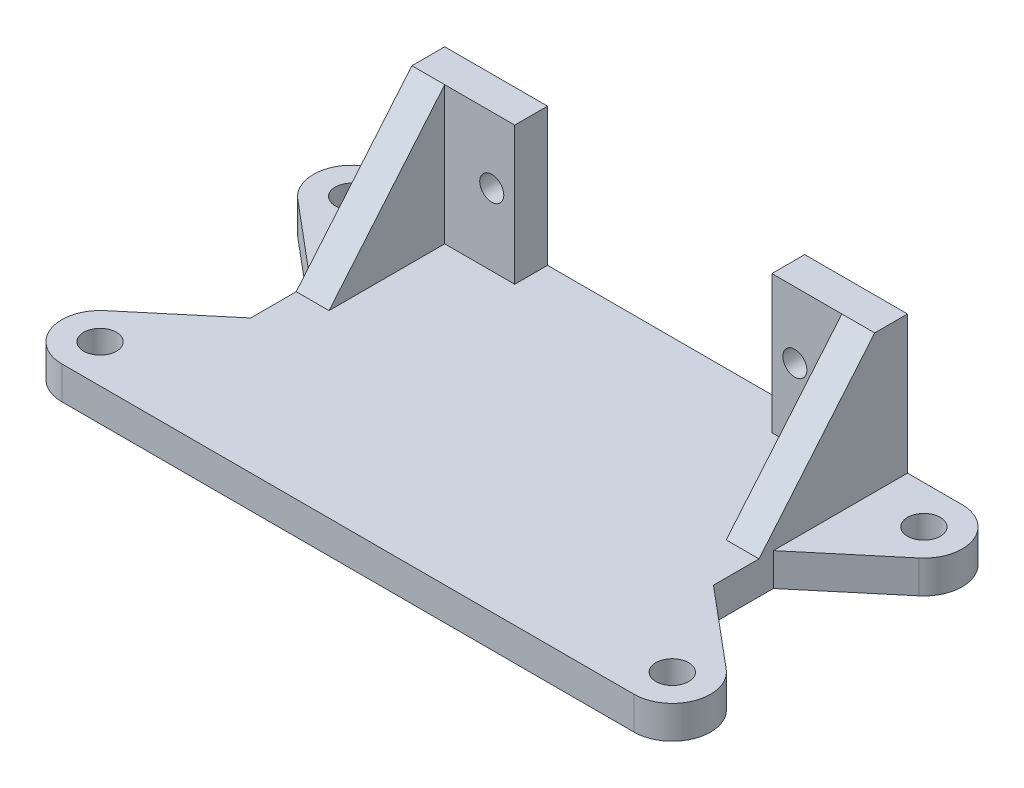
ISO-10303-21;
HEADER;
FILE_DESCRIPTION(('STEP AP214'),'2;1');
FILE_NAME('part.step','',(''),(''),'','','');
FILE_SCHEMA(('AUTOMOTIVE_DESIGN { 1 0 10303 214 1 1 1 1 }'));
ENDSEC;
DATA;
#1=APPLICATION_CONTEXT('core data for automotive mechanical design processes');
#2=APPLICATION_PROTOCOL_DEFINITION('international standard','automotive_design',2000,#1);
#3=PRODUCT_CONTEXT('',#1,'mechanical');
#4=PRODUCT('Part','Part','',(#3));
#5=PRODUCT_RELATED_PRODUCT_CATEGORY('part','',(#4));
#6=PRODUCT_DEFINITION_FORMATION('','',#4);
#7=PRODUCT_DEFINITION_CONTEXT('part definition',#1,'design');
#8=PRODUCT_DEFINITION('design','',#6,#7);
#9=PRODUCT_DEFINITION_SHAPE('','',#8);
#10=(LENGTH_UNIT() NAMED_UNIT(*) SI_UNIT(.MILLI.,.METRE.));
#11=(NAMED_UNIT(*) PLANE_ANGLE_UNIT() SI_UNIT($,.RADIAN.));
#12=(NAMED_UNIT(*) SI_UNIT($,.STERADIAN.) SOLID_ANGLE_UNIT());
#13=UNCERTAINTY_MEASURE_WITH_UNIT(LENGTH_MEASURE(1.E-05),#10,'distance_accuracy_value','');
#14=(GEOMETRIC_REPRESENTATION_CONTEXT(3) GLOBAL_UNCERTAINTY_ASSIGNED_CONTEXT((#13)) GLOBAL_UNIT_ASSIGNED_CONTEXT((#10,
#11,#12)) REPRESENTATION_CONTEXT('',''));
#15=CARTESIAN_POINT('',(0.,0.,0.));
#16=DIRECTION('',(0.,0.,1.));
#17=DIRECTION('',(1.,0.,0.));
#18=AXIS2_PLACEMENT_3D('',#15,#16,#17);
#19=CARTESIAN_POINT('',(21.15,15.6,3.));
#20=DIRECTION('',(1.,0.,0.));
#21=DIRECTION('',(0.,1.,0.));
#22=AXIS2_PLACEMENT_3D('',#19,#20,#21);
#23=PLANE('',#22);
#24=DIRECTION('',(0.,-1.,0.));
#25=VECTOR('',#24,1.);
#26=CARTESIAN_POINT('',(21.15,17.9220001314058,12.2644236685494));
#27=LINE('',#26,#25);
#28=CARTESIAN_POINT('',(21.15,2.99999999999999,12.2644236685494));
#29=VERTEX_POINT('',#28);
#30=CARTESIAN_POINT('',(21.15,0.,12.2644236685494));
#31=VERTEX_POINT('',#30);
#32=EDGE_CURVE('E205',#29,#31,#27,.T.);
#33=ORIENTED_EDGE('',*,*,#32,.F.);
#34=DIRECTION('',(0.,0.,-1.));
#35=VECTOR('',#34,1.);
#36=CARTESIAN_POINT('',(21.15,2.99999999999999,0.));
#37=LINE('',#36,#35);
#38=CARTESIAN_POINT('',(21.15,2.99999999999999,0.));
#39=VERTEX_POINT('',#38);
#40=EDGE_CURVE('E227',#29,#39,#37,.T.);
#41=ORIENTED_EDGE('',*,*,#40,.T.);
#42=DIRECTION('',(0.,-1.,0.));
#43=VECTOR('',#42,1.);
#44=CARTESIAN_POINT('',(21.15,15.6,0.));
#45=LINE('',#44,#43);
#46=CARTESIAN_POINT('',(21.15,15.6,0.));
#47=VERTEX_POINT('',#46);
#48=EDGE_CURVE('E220',#47,#39,#45,.T.);
#49=ORIENTED_EDGE('',*,*,#48,.F.);
#50=DIRECTION('',(0.,0.,-1.));
#51=VECTOR('',#50,1.);
#52=CARTESIAN_POINT('',(21.15,15.6,3.));
#53=LINE('',#52,#51);
#54=CARTESIAN_POINT('',(21.15,15.6,3.));
#55=VERTEX_POINT('',#54);
#56=EDGE_CURVE('E40',#55,#47,#53,.T.);
#57=ORIENTED_EDGE('',*,*,#56,.F.);
#58=DIRECTION('',(0.,-0.766044443118982,0.642787609686535));
#59=VECTOR('',#58,1.);
#60=CARTESIAN_POINT('',(21.15,15.6,3.));
#61=LINE('',#60,#59);
#62=CARTESIAN_POINT('',(21.15,2.99999999999999,13.5726553528336));
#63=VERTEX_POINT('',#62);
#64=EDGE_CURVE('E320',#55,#63,#61,.T.);
#65=ORIENTED_EDGE('',*,*,#64,.T.);
#66=DIRECTION('',(0.,0.,1.));
#67=VECTOR('',#66,1.);
#68=CARTESIAN_POINT('',(21.15,2.99999999999999,0.));
#69=LINE('',#68,#67);
#70=CARTESIAN_POINT('',(21.15,2.99999999999999,17.7355763314506));
#71=VERTEX_POINT('',#70);
#72=EDGE_CURVE('E350',#63,#71,#69,.T.);
#73=ORIENTED_EDGE('',*,*,#72,.T.);
#74=DIRECTION('',(0.,-1.,0.));
#75=VECTOR('',#74,1.);
#76=CARTESIAN_POINT('',(21.15,17.9220001314058,17.7355763314506));
#77=LINE('',#76,#75);
#78=CARTESIAN_POINT('',(21.15,0.,17.7355763314506));
#79=VERTEX_POINT('',#78);
#80=EDGE_CURVE('E245',#71,#79,#77,.T.);
#81=ORIENTED_EDGE('',*,*,#80,.T.);
#82=DIRECTION('',(0.,0.,-1.));
#83=VECTOR('',#82,1.);
#84=CARTESIAN_POINT('',(21.15,0.,3.));
#85=LINE('',#84,#83);
#86=EDGE_CURVE('E403',#79,#31,#85,.T.);
#87=ORIENTED_EDGE('',*,*,#86,.T.);
#88=EDGE_LOOP('',(#33,#41,#49,#57,#65,#73,#81,#87));
#89=FACE_BOUND('',#88,.T.);
#90=ADVANCED_FACE('F36',(#89),#23,.T.);
#91=CARTESIAN_POINT('',(-21.15,0.,3.));
#92=DIRECTION('',(-1.,0.,0.));
#93=DIRECTION('',(0.,-1.,0.));
#94=AXIS2_PLACEMENT_3D('',#91,#92,#93);
#95=PLANE('',#94);
#96=DIRECTION('',(0.,0.,-1.));
#97=VECTOR('',#96,1.);
#98=CARTESIAN_POINT('',(-21.15,2.99999999999999,0.));
#99=LINE('',#98,#97);
#100=CARTESIAN_POINT('',(-21.15,2.99999999999999,12.2644236685494));
#101=VERTEX_POINT('',#100);
#102=CARTESIAN_POINT('',(-21.15,2.99999999999999,0.));
#103=VERTEX_POINT('',#102);
#104=EDGE_CURVE('E61',#101,#103,#99,.T.);
#105=ORIENTED_EDGE('',*,*,#104,.F.);
#106=DIRECTION('',(0.,-1.,0.));
#107=VECTOR('',#106,1.);
#108=CARTESIAN_POINT('',(-21.15,17.9220001314058,12.2644236685494));
#109=LINE('',#108,#107);
#110=CARTESIAN_POINT('',(-21.15,0.,12.2644236685494));
#111=VERTEX_POINT('',#110);
#112=EDGE_CURVE('E271',#101,#111,#109,.T.);
#113=ORIENTED_EDGE('',*,*,#112,.T.);
#114=DIRECTION('',(0.,0.,-1.));
#115=VECTOR('',#114,1.);
#116=CARTESIAN_POINT('',(-21.15,0.,3.));
#117=LINE('',#116,#115);
#118=CARTESIAN_POINT('',(-21.15,0.,17.7355763314506));
#119=VERTEX_POINT('',#118);
#120=EDGE_CURVE('E401',#119,#111,#117,.T.);
#121=ORIENTED_EDGE('',*,*,#120,.F.);
#122=DIRECTION('',(0.,-1.,0.));
#123=VECTOR('',#122,1.);
#124=CARTESIAN_POINT('',(-21.15,17.9220001314058,17.7355763314506));
#125=LINE('',#124,#123);
#126=CARTESIAN_POINT('',(-21.15,2.99999999999999,17.7355763314506));
#127=VERTEX_POINT('',#126);
#128=EDGE_CURVE('E298',#127,#119,#125,.T.);
#129=ORIENTED_EDGE('',*,*,#128,.F.);
#130=DIRECTION('',(0.,0.,-1.));
#131=VECTOR('',#130,1.);
#132=CARTESIAN_POINT('',(-21.15,2.99999999999999,0.));
#133=LINE('',#132,#131);
#134=CARTESIAN_POINT('',(-21.15,2.99999999999999,13.5726553528336));
#135=VERTEX_POINT('',#134);
#136=EDGE_CURVE('E351',#127,#135,#133,.T.);
#137=ORIENTED_EDGE('',*,*,#136,.T.);
#138=DIRECTION('',(0.,-0.766044443118982,0.642787609686535));
#139=VECTOR('',#138,1.);
#140=CARTESIAN_POINT('',(-21.15,15.6,3.));
#141=LINE('',#140,#139);
#142=CARTESIAN_POINT('',(-21.15,15.6,3.));
#143=VERTEX_POINT('',#142);
#144=EDGE_CURVE('E295',#143,#135,#141,.T.);
#145=ORIENTED_EDGE('',*,*,#144,.F.);
#146=DIRECTION('',(0.,0.,-1.));
#147=VECTOR('',#146,1.);
#148=CARTESIAN_POINT('',(-21.15,15.6,3.));
#149=LINE('',#148,#147);
#150=CARTESIAN_POINT('',(-21.15,15.6,0.));
#151=VERTEX_POINT('',#150);
#152=EDGE_CURVE('E398',#143,#151,#149,.T.);
#153=ORIENTED_EDGE('',*,*,#152,.T.);
#154=DIRECTION('',(0.,1.,0.));
#155=VECTOR('',#154,1.);
#156=CARTESIAN_POINT('',(-21.15,0.,0.));
#157=LINE('',#156,#155);
#158=EDGE_CURVE('E380',#103,#151,#157,.T.);
#159=ORIENTED_EDGE('',*,*,#158,.F.);
#160=EDGE_LOOP('',(#105,#113,#121,#129,#137,#145,#153,#159));
#161=FACE_BOUND('',#160,.T.);
#162=ADVANCED_FACE('F465',(#161),#95,.T.);
#163=CARTESIAN_POINT('',(-11.75,2.99999999999999,3.));
#164=DIRECTION('',(0.,1.,0.));
#165=DIRECTION('',(0.,0.,1.));
#166=AXIS2_PLACEMENT_3D('',#163,#164,#165);
#167=PLANE('',#166);
#168=DIRECTION('',(0.,0.,-1.));
#169=VECTOR('',#168,1.);
#170=CARTESIAN_POINT('',(-18.15,2.99999999999999,13.5726553528336));
#171=LINE('',#170,#169);
#172=CARTESIAN_POINT('',(-18.15,2.99999999999999,13.5726553528336));
#173=VERTEX_POINT('',#172);
#174=CARTESIAN_POINT('',(-18.15,2.99999999999999,3.));
#175=VERTEX_POINT('',#174);
#176=EDGE_CURVE('E311',#173,#175,#171,.T.);
#177=ORIENTED_EDGE('',*,*,#176,.F.);
#178=DIRECTION('',(-1.,0.,0.));
#179=VECTOR('',#178,1.);
#180=CARTESIAN_POINT('',(-18.15,2.99999999999999,13.5726553528336));
#181=LINE('',#180,#179);
#182=EDGE_CURVE('E315',#173,#135,#181,.T.);
#183=ORIENTED_EDGE('',*,*,#182,.T.);
#184=ORIENTED_EDGE('',*,*,#136,.F.);
#185=DIRECTION('',(0.76604444311898,0.,-0.642787609686538));
#186=VECTOR('',#185,1.);
#187=CARTESIAN_POINT('',(-28.3997566339029,2.99999999999999,23.8188444490836));
#188=LINE('',#187,#186);
#189=CARTESIAN_POINT('',(-28.3997566339029,2.99999999999999,23.8188444490836));
#190=VERTEX_POINT('',#189);
#191=EDGE_CURVE('E275',#190,#127,#188,.T.);
#192=ORIENTED_EDGE('',*,*,#191,.F.);
#193=CARTESIAN_POINT('',(-26.15,2.99999999999999,26.5));
#194=DIRECTION('',(0.,1.,0.));
#195=DIRECTION('',(0.,0.,1.));
#196=AXIS2_PLACEMENT_3D('',#193,#194,#195);
#197=CIRCLE('',#196,3.5);
#198=CARTESIAN_POINT('',(-26.15,2.99999999999999,30.));
#199=VERTEX_POINT('',#198);
#200=EDGE_CURVE('E299',#199,#190,#197,.F.);
#201=ORIENTED_EDGE('',*,*,#200,.F.);
#202=DIRECTION('',(-1.,0.,0.));
#203=VECTOR('',#202,1.);
#204=CARTESIAN_POINT('',(-21.15,2.99999999999999,30.));
#205=LINE('',#204,#203);
#206=CARTESIAN_POINT('',(26.15,2.99999999999999,30.));
#207=VERTEX_POINT('',#206);
#208=EDGE_CURVE('E354',#207,#199,#205,.T.);
#209=ORIENTED_EDGE('',*,*,#208,.F.);
#210=CARTESIAN_POINT('',(26.15,2.99999999999999,26.5));
#211=DIRECTION('',(0.,1.,0.));
#212=DIRECTION('',(0.,0.,1.));
#213=AXIS2_PLACEMENT_3D('',#210,#211,#212);
#214=CIRCLE('',#213,3.5);
#215=CARTESIAN_POINT('',(28.3997566339029,2.99999999999999,23.8188444490836));
#216=VERTEX_POINT('',#215);
#217=EDGE_CURVE('E234',#207,#216,#214,.T.);
#218=ORIENTED_EDGE('',*,*,#217,.T.);
#219=DIRECTION('',(-0.76604444311898,0.,-0.642787609686538));
#220=VECTOR('',#219,1.);
#221=CARTESIAN_POINT('',(28.3997566339029,2.99999999999999,23.8188444490836));
#222=LINE('',#221,#220);
#223=EDGE_CURVE('E231',#216,#71,#222,.T.);
#224=ORIENTED_EDGE('',*,*,#223,.T.);
#225=ORIENTED_EDGE('',*,*,#72,.F.);
#226=DIRECTION('',(1.,0.,0.));
#227=VECTOR('',#226,1.);
#228=CARTESIAN_POINT('',(18.15,2.99999999999999,13.5726553528336));
#229=LINE('',#228,#227);
#230=CARTESIAN_POINT('',(18.15,2.99999999999999,13.5726553528336));
#231=VERTEX_POINT('',#230);
#232=EDGE_CURVE('E332',#231,#63,#229,.T.);
#233=ORIENTED_EDGE('',*,*,#232,.F.);
#234=DIRECTION('',(0.,0.,-1.));
#235=VECTOR('',#234,1.);
#236=CARTESIAN_POINT('',(18.15,2.99999999999999,13.5726553528336));
#237=LINE('',#236,#235);
#238=CARTESIAN_POINT('',(18.15,2.99999999999999,3.));
#239=VERTEX_POINT('',#238);
#240=EDGE_CURVE('E326',#231,#239,#237,.T.);
#241=ORIENTED_EDGE('',*,*,#240,.T.);
#242=DIRECTION('',(1.,0.,0.));
#243=VECTOR('',#242,1.);
#244=CARTESIAN_POINT('',(0.,2.99999999999999,3.));
#245=LINE('',#244,#243);
#246=CARTESIAN_POINT('',(11.75,2.99999999999999,3.));
#247=VERTEX_POINT('',#246);
#248=EDGE_CURVE('E353',#247,#239,#245,.T.);
#249=ORIENTED_EDGE('',*,*,#248,.F.);
#250=DIRECTION('',(0.,0.,-1.));
#251=VECTOR('',#250,1.);
#252=CARTESIAN_POINT('',(11.75,2.99999999999999,3.));
#253=LINE('',#252,#251);
#254=CARTESIAN_POINT('',(11.75,2.99999999999999,0.));
#255=VERTEX_POINT('',#254);
#256=EDGE_CURVE('E45',#247,#255,#253,.T.);
#257=ORIENTED_EDGE('',*,*,#256,.T.);
#258=DIRECTION('',(1.,0.,0.));
#259=VECTOR('',#258,1.);
#260=CARTESIAN_POINT('',(-11.75,2.99999999999999,0.));
#261=LINE('',#260,#259);
#262=CARTESIAN_POINT('',(-11.75,2.99999999999999,0.));
#263=VERTEX_POINT('',#262);
#264=EDGE_CURVE('E388',#263,#255,#261,.T.);
#265=ORIENTED_EDGE('',*,*,#264,.F.);
#266=DIRECTION('',(0.,0.,-1.));
#267=VECTOR('',#266,1.);
#268=CARTESIAN_POINT('',(-11.75,2.99999999999999,3.));
#269=LINE('',#268,#267);
#270=CARTESIAN_POINT('',(-11.75,2.99999999999999,3.));
#271=VERTEX_POINT('',#270);
#272=EDGE_CURVE('E394',#271,#263,#269,.T.);
#273=ORIENTED_EDGE('',*,*,#272,.F.);
#274=EDGE_CURVE('E360',#175,#271,#245,.T.);
#275=ORIENTED_EDGE('',*,*,#274,.F.);
#276=EDGE_LOOP('',(#177,#183,#184,#192,#201,#209,#218,#224,#225,#233,#241,#249,#257,#265,#273,#275));
#277=FACE_BOUND('',#276,.T.);
#278=CARTESIAN_POINT('',(-26.15,2.99999999999999,26.5));
#279=DIRECTION('',(0.,1.,0.));
#280=DIRECTION('',(0.,0.,1.));
#281=AXIS2_PLACEMENT_3D('',#278,#279,#280);
#282=CIRCLE('',#281,1.5);
#283=CARTESIAN_POINT('',(-26.15,2.99999999999999,28.));
#284=VERTEX_POINT('',#283);
#285=EDGE_CURVE('E285',#284,#284,#282,.F.);
#286=ORIENTED_EDGE('',*,*,#285,.T.);
#287=EDGE_LOOP('',(#286));
#288=FACE_BOUND('',#287,.T.);
#289=CARTESIAN_POINT('',(26.15,2.99999999999999,26.5));
#290=DIRECTION('',(0.,1.,0.));
#291=DIRECTION('',(0.,0.,1.));
#292=AXIS2_PLACEMENT_3D('',#289,#290,#291);
#293=CIRCLE('',#292,1.5);
#294=CARTESIAN_POINT('',(26.15,2.99999999999999,28.));
#295=VERTEX_POINT('',#294);
#296=EDGE_CURVE('E235',#295,#295,#293,.T.);
#297=ORIENTED_EDGE('',*,*,#296,.F.);
#298=EDGE_LOOP('',(#297));
#299=FACE_BOUND('',#298,.T.);
#300=ADVANCED_FACE('F427',(#277,#288,#299),#167,.T.);
#301=CARTESIAN_POINT('',(0.,0.,3.));
#302=DIRECTION('',(0.,0.,-1.));
#303=DIRECTION('',(-1.,0.,0.));
#304=AXIS2_PLACEMENT_3D('',#301,#302,#303);
#305=PLANE('',#304);
#306=CARTESIAN_POINT('',(-13.85,9.54999999999999,3.));
#307=DIRECTION('',(0.,0.,1.));
#308=DIRECTION('',(1.,0.,0.));
#309=AXIS2_PLACEMENT_3D('',#306,#307,#308);
#310=CIRCLE('',#309,1.1);
#311=CARTESIAN_POINT('',(-12.75,9.54999999999999,3.));
#312=VERTEX_POINT('',#311);
#313=EDGE_CURVE('E334',#312,#312,#310,.T.);
#314=ORIENTED_EDGE('',*,*,#313,.F.);
#315=EDGE_LOOP('',(#314));
#316=FACE_BOUND('',#315,.T.);
#317=DIRECTION('',(1.,0.,0.));
#318=VECTOR('',#317,1.);
#319=CARTESIAN_POINT('',(-21.15,15.6,3.));
#320=LINE('',#319,#318);
#321=CARTESIAN_POINT('',(-18.15,15.6,3.));
#322=VERTEX_POINT('',#321);
#323=CARTESIAN_POINT('',(-11.75,15.6,3.));
#324=VERTEX_POINT('',#323);
#325=EDGE_CURVE('E364',#322,#324,#320,.T.);
#326=ORIENTED_EDGE('',*,*,#325,.F.);
#327=DIRECTION('',(0.,1.,0.));
#328=VECTOR('',#327,1.);
#329=CARTESIAN_POINT('',(-18.15,2.99999999999999,3.));
#330=LINE('',#329,#328);
#331=EDGE_CURVE('E308',#175,#322,#330,.T.);
#332=ORIENTED_EDGE('',*,*,#331,.F.);
#333=ORIENTED_EDGE('',*,*,#274,.T.);
#334=DIRECTION('',(0.,-1.,0.));
#335=VECTOR('',#334,1.);
#336=CARTESIAN_POINT('',(-11.75,15.6,3.));
#337=LINE('',#336,#335);
#338=EDGE_CURVE('E369',#324,#271,#337,.T.);
#339=ORIENTED_EDGE('',*,*,#338,.F.);
#340=EDGE_LOOP('',(#326,#332,#333,#339));
#341=FACE_BOUND('',#340,.T.);
#342=ADVANCED_FACE('F459',(#316,#341),#305,.F.);
#343=CARTESIAN_POINT('',(11.75,15.6,3.));
#344=DIRECTION('',(0.,1.,0.));
#345=DIRECTION('',(0.,0.,1.));
#346=AXIS2_PLACEMENT_3D('',#343,#344,#345);
#347=PLANE('',#346);
#348=DIRECTION('',(1.,0.,0.));
#349=VECTOR('',#348,1.);
#350=CARTESIAN_POINT('',(11.75,15.6,0.));
#351=LINE('',#350,#349);
#352=CARTESIAN_POINT('',(11.75,15.6,0.));
#353=VERTEX_POINT('',#352);
#354=EDGE_CURVE('E375',#353,#47,#351,.T.);
#355=ORIENTED_EDGE('',*,*,#354,.F.);
#356=DIRECTION('',(0.,0.,-1.));
#357=VECTOR('',#356,1.);
#358=CARTESIAN_POINT('',(11.75,15.6,3.));
#359=LINE('',#358,#357);
#360=CARTESIAN_POINT('',(11.75,15.6,3.));
#361=VERTEX_POINT('',#360);
#362=EDGE_CURVE('E11',#361,#353,#359,.T.);
#363=ORIENTED_EDGE('',*,*,#362,.F.);
#364=DIRECTION('',(1.,0.,0.));
#365=VECTOR('',#364,1.);
#366=CARTESIAN_POINT('',(11.75,15.6,3.));
#367=LINE('',#366,#365);
#368=CARTESIAN_POINT('',(18.15,15.6,3.));
#369=VERTEX_POINT('',#368);
#370=EDGE_CURVE('E361',#361,#369,#367,.T.);
#371=ORIENTED_EDGE('',*,*,#370,.T.);
#372=DIRECTION('',(1.,0.,0.));
#373=VECTOR('',#372,1.);
#374=CARTESIAN_POINT('',(18.15,15.6,3.));
#375=LINE('',#374,#373);
#376=EDGE_CURVE('E329',#369,#55,#375,.T.);
#377=ORIENTED_EDGE('',*,*,#376,.T.);
#378=ORIENTED_EDGE('',*,*,#56,.T.);
#379=EDGE_LOOP('',(#355,#363,#371,#377,#378));
#380=FACE_BOUND('',#379,.T.);
#381=ADVANCED_FACE('F38',(#380),#347,.T.);
#382=CARTESIAN_POINT('',(11.75,2.99999999999999,3.));
#383=DIRECTION('',(-1.,0.,0.));
#384=DIRECTION('',(0.,0.,1.));
#385=AXIS2_PLACEMENT_3D('',#382,#383,#384);
#386=PLANE('',#385);
#387=DIRECTION('',(0.,1.,0.));
#388=VECTOR('',#387,1.);
#389=CARTESIAN_POINT('',(11.75,2.99999999999999,0.));
#390=LINE('',#389,#388);
#391=EDGE_CURVE('E365',#255,#353,#390,.T.);
#392=ORIENTED_EDGE('',*,*,#391,.F.);
#393=ORIENTED_EDGE('',*,*,#256,.F.);
#394=DIRECTION('',(0.,1.,0.));
#395=VECTOR('',#394,1.);
#396=CARTESIAN_POINT('',(11.75,2.99999999999999,3.));
#397=LINE('',#396,#395);
#398=EDGE_CURVE('E372',#247,#361,#397,.T.);
#399=ORIENTED_EDGE('',*,*,#398,.T.);
#400=ORIENTED_EDGE('',*,*,#362,.T.);
#401=EDGE_LOOP('',(#392,#393,#399,#400));
#402=FACE_BOUND('',#401,.T.);
#403=ADVANCED_FACE('F415',(#402),#386,.T.);
#404=CARTESIAN_POINT('',(-11.75,15.6,3.));
#405=DIRECTION('',(1.,0.,0.));
#406=DIRECTION('',(0.,0.,-1.));
#407=AXIS2_PLACEMENT_3D('',#404,#405,#406);
#408=PLANE('',#407);
#409=DIRECTION('',(0.,-1.,0.));
#410=VECTOR('',#409,1.);
#411=CARTESIAN_POINT('',(-11.75,15.6,0.));
#412=LINE('',#411,#410);
#413=CARTESIAN_POINT('',(-11.75,15.6,0.));
#414=VERTEX_POINT('',#413);
#415=EDGE_CURVE('E385',#414,#263,#412,.T.);
#416=ORIENTED_EDGE('',*,*,#415,.F.);
#417=DIRECTION('',(0.,0.,-1.));
#418=VECTOR('',#417,1.);
#419=CARTESIAN_POINT('',(-11.75,15.6,3.));
#420=LINE('',#419,#418);
#421=EDGE_CURVE('E396',#324,#414,#420,.T.);
#422=ORIENTED_EDGE('',*,*,#421,.F.);
#423=ORIENTED_EDGE('',*,*,#338,.T.);
#424=ORIENTED_EDGE('',*,*,#272,.T.);
#425=EDGE_LOOP('',(#416,#422,#423,#424));
#426=FACE_BOUND('',#425,.T.);
#427=ADVANCED_FACE('F460',(#426),#408,.T.);
#428=CARTESIAN_POINT('',(-21.15,15.6,3.));
#429=DIRECTION('',(0.,1.,0.));
#430=DIRECTION('',(0.,0.,1.));
#431=AXIS2_PLACEMENT_3D('',#428,#429,#430);
#432=PLANE('',#431);
#433=DIRECTION('',(1.,0.,0.));
#434=VECTOR('',#433,1.);
#435=CARTESIAN_POINT('',(-21.15,15.6,0.));
#436=LINE('',#435,#434);
#437=EDGE_CURVE('E382',#151,#414,#436,.T.);
#438=ORIENTED_EDGE('',*,*,#437,.F.);
#439=ORIENTED_EDGE('',*,*,#152,.F.);
#440=EDGE_CURVE('E366',#143,#322,#320,.T.);
#441=ORIENTED_EDGE('',*,*,#440,.T.);
#442=ORIENTED_EDGE('',*,*,#325,.T.);
#443=ORIENTED_EDGE('',*,*,#421,.T.);
#444=EDGE_LOOP('',(#438,#439,#441,#442,#443));
#445=FACE_BOUND('',#444,.T.);
#446=ADVANCED_FACE('F451',(#445),#432,.T.);
#447=CARTESIAN_POINT('',(21.15,0.,3.));
#448=DIRECTION('',(0.,-1.,0.));
#449=DIRECTION('',(0.,0.,-1.));
#450=AXIS2_PLACEMENT_3D('',#447,#448,#449);
#451=PLANE('',#450);
#452=DIRECTION('',(-1.,0.,0.));
#453=VECTOR('',#452,1.);
#454=CARTESIAN_POINT('',(21.15,0.,0.));
#455=LINE('',#454,#453);
#456=CARTESIAN_POINT('',(26.15,0.,0.));
#457=VERTEX_POINT('',#456);
#458=CARTESIAN_POINT('',(-26.15,0.,0.));
#459=VERTEX_POINT('',#458);
#460=EDGE_CURVE('E378',#457,#459,#455,.T.);
#461=ORIENTED_EDGE('',*,*,#460,.F.);
#462=CARTESIAN_POINT('',(26.15,0.,3.5));
#463=DIRECTION('',(0.,-1.,0.));
#464=DIRECTION('',(0.,0.,1.));
#465=AXIS2_PLACEMENT_3D('',#462,#463,#464);
#466=CIRCLE('',#465,3.5);
#467=CARTESIAN_POINT('',(28.3997566339029,0.,6.18115555091643));
#468=VERTEX_POINT('',#467);
#469=EDGE_CURVE('E212',#457,#468,#466,.T.);
#470=ORIENTED_EDGE('',*,*,#469,.T.);
#471=DIRECTION('',(-0.76604444311898,0.,0.642787609686538));
#472=VECTOR('',#471,1.);
#473=CARTESIAN_POINT('',(28.3997566339029,0.,6.18115555091643));
#474=LINE('',#473,#472);
#475=EDGE_CURVE('E439',#468,#31,#474,.T.);
#476=ORIENTED_EDGE('',*,*,#475,.T.);
#477=ORIENTED_EDGE('',*,*,#86,.F.);
#478=DIRECTION('',(-0.76604444311898,0.,-0.642787609686538));
#479=VECTOR('',#478,1.);
#480=CARTESIAN_POINT('',(28.3997566339029,0.,23.8188444490836));
#481=LINE('',#480,#479);
#482=CARTESIAN_POINT('',(28.3997566339029,0.,23.8188444490836));
#483=VERTEX_POINT('',#482);
#484=EDGE_CURVE('E53',#483,#79,#481,.T.);
#485=ORIENTED_EDGE('',*,*,#484,.F.);
#486=CARTESIAN_POINT('',(26.15,0.,26.5));
#487=DIRECTION('',(0.,1.,0.));
#488=DIRECTION('',(0.,0.,-1.));
#489=AXIS2_PLACEMENT_3D('',#486,#487,#488);
#490=CIRCLE('',#489,3.5);
#491=CARTESIAN_POINT('',(26.15,0.,30.));
#492=VERTEX_POINT('',#491);
#493=EDGE_CURVE('E242',#492,#483,#490,.T.);
#494=ORIENTED_EDGE('',*,*,#493,.F.);
#495=DIRECTION('',(-1.,0.,0.));
#496=VECTOR('',#495,1.);
#497=CARTESIAN_POINT('',(-21.15,0.,30.));
#498=LINE('',#497,#496);
#499=CARTESIAN_POINT('',(-26.15,0.,30.));
#500=VERTEX_POINT('',#499);
#501=EDGE_CURVE('E340',#492,#500,#498,.T.);
#502=ORIENTED_EDGE('',*,*,#501,.T.);
#503=CARTESIAN_POINT('',(-26.15,0.,26.5));
#504=DIRECTION('',(0.,-1.,0.));
#505=DIRECTION('',(0.,0.,-1.));
#506=AXIS2_PLACEMENT_3D('',#503,#504,#505);
#507=CIRCLE('',#506,3.5);
#508=CARTESIAN_POINT('',(-28.3997566339029,0.,23.8188444490836));
#509=VERTEX_POINT('',#508);
#510=EDGE_CURVE('E286',#500,#509,#507,.T.);
#511=ORIENTED_EDGE('',*,*,#510,.T.);
#512=DIRECTION('',(0.76604444311898,0.,-0.642787609686538));
#513=VECTOR('',#512,1.);
#514=CARTESIAN_POINT('',(-28.3997566339029,0.,23.8188444490836));
#515=LINE('',#514,#513);
#516=EDGE_CURVE('E282',#509,#119,#515,.T.);
#517=ORIENTED_EDGE('',*,*,#516,.T.);
#518=ORIENTED_EDGE('',*,*,#120,.T.);
#519=DIRECTION('',(0.76604444311898,0.,0.642787609686538));
#520=VECTOR('',#519,1.);
#521=CARTESIAN_POINT('',(-28.3997566339029,0.,6.18115555091643));
#522=LINE('',#521,#520);
#523=CARTESIAN_POINT('',(-28.3997566339029,0.,6.18115555091643));
#524=VERTEX_POINT('',#523);
#525=EDGE_CURVE('E266',#524,#111,#522,.T.);
#526=ORIENTED_EDGE('',*,*,#525,.F.);
#527=CARTESIAN_POINT('',(-26.15,0.,3.5));
#528=DIRECTION('',(0.,1.,0.));
#529=DIRECTION('',(0.,0.,1.));
#530=AXIS2_PLACEMENT_3D('',#527,#528,#529);
#531=CIRCLE('',#530,3.5);
#532=EDGE_CURVE('E268',#459,#524,#531,.T.);
#533=ORIENTED_EDGE('',*,*,#532,.F.);
#534=EDGE_LOOP('',(#461,#470,#476,#477,#485,#494,#502,#511,#517,#518,#526,#533));
#535=FACE_BOUND('',#534,.T.);
#536=CARTESIAN_POINT('',(-26.15,0.,26.5));
#537=DIRECTION('',(0.,-1.,0.));
#538=DIRECTION('',(0.,0.,-1.));
#539=AXIS2_PLACEMENT_3D('',#536,#537,#538);
#540=CIRCLE('',#539,1.5);
#541=CARTESIAN_POINT('',(-26.15,0.,25.));
#542=VERTEX_POINT('',#541);
#543=EDGE_CURVE('E289',#542,#542,#540,.T.);
#544=ORIENTED_EDGE('',*,*,#543,.F.);
#545=EDGE_LOOP('',(#544));
#546=FACE_BOUND('',#545,.T.);
#547=CARTESIAN_POINT('',(-26.15,0.,3.5));
#548=DIRECTION('',(0.,1.,0.));
#549=DIRECTION('',(0.,0.,1.));
#550=AXIS2_PLACEMENT_3D('',#547,#548,#549);
#551=CIRCLE('',#550,1.5);
#552=CARTESIAN_POINT('',(-26.15,0.,5.));
#553=VERTEX_POINT('',#552);
#554=EDGE_CURVE('E263',#553,#553,#551,.T.);
#555=ORIENTED_EDGE('',*,*,#554,.T.);
#556=EDGE_LOOP('',(#555));
#557=FACE_BOUND('',#556,.T.);
#558=CARTESIAN_POINT('',(26.15,0.,26.5));
#559=DIRECTION('',(0.,1.,0.));
#560=DIRECTION('',(0.,0.,-1.));
#561=AXIS2_PLACEMENT_3D('',#558,#559,#560);
#562=CIRCLE('',#561,1.5);
#563=CARTESIAN_POINT('',(26.15,0.,25.));
#564=VERTEX_POINT('',#563);
#565=EDGE_CURVE('E238',#564,#564,#562,.T.);
#566=ORIENTED_EDGE('',*,*,#565,.T.);
#567=EDGE_LOOP('',(#566));
#568=FACE_BOUND('',#567,.T.);
#569=CARTESIAN_POINT('',(26.15,0.,3.5));
#570=DIRECTION('',(0.,-1.,0.));
#571=DIRECTION('',(0.,0.,1.));
#572=AXIS2_PLACEMENT_3D('',#569,#570,#571);
#573=CIRCLE('',#572,1.5);
#574=CARTESIAN_POINT('',(26.15,0.,5.));
#575=VERTEX_POINT('',#574);
#576=EDGE_CURVE('E214',#575,#575,#573,.T.);
#577=ORIENTED_EDGE('',*,*,#576,.F.);
#578=EDGE_LOOP('',(#577));
#579=FACE_BOUND('',#578,.T.);
#580=ADVANCED_FACE('F435',(#535,#546,#557,#568,#579),#451,.T.);
#581=CARTESIAN_POINT('',(13.85,9.54999999999999,3.));
#582=DIRECTION('',(0.,0.,1.));
#583=DIRECTION('',(1.,0.,0.));
#584=AXIS2_PLACEMENT_3D('',#581,#582,#583);
#585=CIRCLE('',#584,1.1);
#586=CARTESIAN_POINT('',(14.95,9.54999999999999,3.));
#587=VERTEX_POINT('',#586);
#588=EDGE_CURVE('E341',#587,#587,#585,.T.);
#589=ORIENTED_EDGE('',*,*,#588,.F.);
#590=EDGE_LOOP('',(#589));
#591=FACE_BOUND('',#590,.T.);
#592=ORIENTED_EDGE('',*,*,#248,.T.);
#593=DIRECTION('',(0.,1.,0.));
#594=VECTOR('',#593,1.);
#595=CARTESIAN_POINT('',(18.15,2.99999999999999,3.));
#596=LINE('',#595,#594);
#597=EDGE_CURVE('E321',#239,#369,#596,.T.);
#598=ORIENTED_EDGE('',*,*,#597,.T.);
#599=ORIENTED_EDGE('',*,*,#370,.F.);
#600=ORIENTED_EDGE('',*,*,#398,.F.);
#601=EDGE_LOOP('',(#592,#598,#599,#600));
#602=FACE_BOUND('',#601,.T.);
#603=ADVANCED_FACE('F419',(#591,#602),#305,.F.);
#604=CARTESIAN_POINT('',(0.,0.,0.));
#605=DIRECTION('',(0.,0.,-1.));
#606=DIRECTION('',(-1.,0.,0.));
#607=AXIS2_PLACEMENT_3D('',#604,#605,#606);
#608=PLANE('',#607);
#609=CARTESIAN_POINT('',(13.85,9.54999999999999,0.));
#610=DIRECTION('',(0.,0.,1.));
#611=DIRECTION('',(1.,0.,0.));
#612=AXIS2_PLACEMENT_3D('',#609,#610,#611);
#613=CIRCLE('',#612,1.1);
#614=CARTESIAN_POINT('',(14.95,9.54999999999999,0.));
#615=VERTEX_POINT('',#614);
#616=EDGE_CURVE('E337',#615,#615,#613,.T.);
#617=ORIENTED_EDGE('',*,*,#616,.T.);
#618=EDGE_LOOP('',(#617));
#619=FACE_BOUND('',#618,.T.);
#620=CARTESIAN_POINT('',(-13.85,9.54999999999999,0.));
#621=DIRECTION('',(0.,0.,1.));
#622=DIRECTION('',(1.,0.,0.));
#623=AXIS2_PLACEMENT_3D('',#620,#621,#622);
#624=CIRCLE('',#623,1.1);
#625=CARTESIAN_POINT('',(-12.75,9.54999999999999,0.));
#626=VERTEX_POINT('',#625);
#627=EDGE_CURVE('E344',#626,#626,#624,.T.);
#628=ORIENTED_EDGE('',*,*,#627,.T.);
#629=EDGE_LOOP('',(#628));
#630=FACE_BOUND('',#629,.T.);
#631=ORIENTED_EDGE('',*,*,#48,.T.);
#632=DIRECTION('',(1.,0.,0.));
#633=VECTOR('',#632,1.);
#634=CARTESIAN_POINT('',(21.15,2.99999999999999,0.));
#635=LINE('',#634,#633);
#636=CARTESIAN_POINT('',(26.15,2.99999999999999,0.));
#637=VERTEX_POINT('',#636);
#638=EDGE_CURVE('E198',#39,#637,#635,.T.);
#639=ORIENTED_EDGE('',*,*,#638,.T.);
#640=DIRECTION('',(0.,-1.,0.));
#641=VECTOR('',#640,1.);
#642=CARTESIAN_POINT('',(26.15,17.9220001314058,0.));
#643=LINE('',#642,#641);
#644=EDGE_CURVE('E209',#637,#457,#643,.T.);
#645=ORIENTED_EDGE('',*,*,#644,.T.);
#646=ORIENTED_EDGE('',*,*,#460,.T.);
#647=DIRECTION('',(0.,-1.,0.));
#648=VECTOR('',#647,1.);
#649=CARTESIAN_POINT('',(-26.15,17.9220001314058,0.));
#650=LINE('',#649,#648);
#651=CARTESIAN_POINT('',(-26.15,2.99999999999999,0.));
#652=VERTEX_POINT('',#651);
#653=EDGE_CURVE('E272',#652,#459,#650,.T.);
#654=ORIENTED_EDGE('',*,*,#653,.F.);
#655=DIRECTION('',(-1.,0.,0.));
#656=VECTOR('',#655,1.);
#657=CARTESIAN_POINT('',(-21.15,2.99999999999999,0.));
#658=LINE('',#657,#656);
#659=EDGE_CURVE('E260',#103,#652,#658,.T.);
#660=ORIENTED_EDGE('',*,*,#659,.F.);
#661=ORIENTED_EDGE('',*,*,#158,.T.);
#662=ORIENTED_EDGE('',*,*,#437,.T.);
#663=ORIENTED_EDGE('',*,*,#415,.T.);
#664=ORIENTED_EDGE('',*,*,#264,.T.);
#665=ORIENTED_EDGE('',*,*,#391,.T.);
#666=ORIENTED_EDGE('',*,*,#354,.T.);
#667=EDGE_LOOP('',(#631,#639,#645,#646,#654,#660,#661,#662,#663,#664,#665,#666));
#668=FACE_BOUND('',#667,.T.);
#669=ADVANCED_FACE('F217',(#619,#630,#668),#608,.T.);
#670=CARTESIAN_POINT('',(-21.15,54.8583648026044,30.));
#671=DIRECTION('',(0.,0.,1.));
#672=DIRECTION('',(1.,0.,0.));
#673=AXIS2_PLACEMENT_3D('',#670,#671,#672);
#674=PLANE('',#673);
#675=ORIENTED_EDGE('',*,*,#501,.F.);
#676=DIRECTION('',(0.,-1.,0.));
#677=VECTOR('',#676,1.);
#678=CARTESIAN_POINT('',(26.15,17.9220001314058,30.));
#679=LINE('',#678,#677);
#680=EDGE_CURVE('E246',#207,#492,#679,.T.);
#681=ORIENTED_EDGE('',*,*,#680,.F.);
#682=ORIENTED_EDGE('',*,*,#208,.T.);
#683=DIRECTION('',(0.,-1.,0.));
#684=VECTOR('',#683,1.);
#685=CARTESIAN_POINT('',(-26.15,17.9220001314058,30.));
#686=LINE('',#685,#684);
#687=EDGE_CURVE('E292',#199,#500,#686,.T.);
#688=ORIENTED_EDGE('',*,*,#687,.T.);
#689=EDGE_LOOP('',(#675,#681,#682,#688));
#690=FACE_BOUND('',#689,.T.);
#691=ADVANCED_FACE('F481',(#690),#674,.T.);
#692=CARTESIAN_POINT('',(-13.85,9.54999999999999,0.));
#693=DIRECTION('',(0.,0.,1.));
#694=DIRECTION('',(1.,0.,0.));
#695=AXIS2_PLACEMENT_3D('',#692,#693,#694);
#696=CYLINDRICAL_SURFACE('',#695,1.1);
#697=ORIENTED_EDGE('',*,*,#627,.F.);
#698=EDGE_LOOP('',(#697));
#699=FACE_BOUND('',#698,.T.);
#700=ORIENTED_EDGE('',*,*,#313,.T.);
#701=EDGE_LOOP('',(#700));
#702=FACE_BOUND('',#701,.T.);
#703=ADVANCED_FACE('F486',(#699,#702),#696,.F.);
#704=CARTESIAN_POINT('',(13.85,9.54999999999999,0.));
#705=DIRECTION('',(0.,0.,1.));
#706=DIRECTION('',(1.,0.,0.));
#707=AXIS2_PLACEMENT_3D('',#704,#705,#706);
#708=CYLINDRICAL_SURFACE('',#707,1.1);
#709=ORIENTED_EDGE('',*,*,#616,.F.);
#710=EDGE_LOOP('',(#709));
#711=FACE_BOUND('',#710,.T.);
#712=ORIENTED_EDGE('',*,*,#588,.T.);
#713=EDGE_LOOP('',(#712));
#714=FACE_BOUND('',#713,.T.);
#715=ADVANCED_FACE('F490',(#711,#714),#708,.F.);
#716=CARTESIAN_POINT('',(18.15,15.6,3.));
#717=DIRECTION('',(0.,0.642787609686535,0.766044443118982));
#718=DIRECTION('',(0.,-0.766044443118982,0.642787609686535));
#719=AXIS2_PLACEMENT_3D('',#716,#717,#718);
#720=PLANE('',#719);
#721=ORIENTED_EDGE('',*,*,#64,.F.);
#722=ORIENTED_EDGE('',*,*,#376,.F.);
#723=DIRECTION('',(0.,-0.766044443118982,0.642787609686535));
#724=VECTOR('',#723,1.);
#725=CARTESIAN_POINT('',(18.15,15.6,3.));
#726=LINE('',#725,#724);
#727=EDGE_CURVE('E324',#369,#231,#726,.T.);
#728=ORIENTED_EDGE('',*,*,#727,.T.);
#729=ORIENTED_EDGE('',*,*,#232,.T.);
#730=EDGE_LOOP('',(#721,#722,#728,#729));
#731=FACE_BOUND('',#730,.T.);
#732=ADVANCED_FACE('F431',(#731),#720,.T.);
#733=CARTESIAN_POINT('',(18.15,0.,0.));
#734=DIRECTION('',(-1.,0.,0.));
#735=DIRECTION('',(0.,-1.,0.));
#736=AXIS2_PLACEMENT_3D('',#733,#734,#735);
#737=PLANE('',#736);
#738=ORIENTED_EDGE('',*,*,#597,.F.);
#739=ORIENTED_EDGE('',*,*,#240,.F.);
#740=ORIENTED_EDGE('',*,*,#727,.F.);
#741=EDGE_LOOP('',(#738,#739,#740));
#742=FACE_BOUND('',#741,.T.);
#743=ADVANCED_FACE('F423',(#742),#737,.T.);
#744=CARTESIAN_POINT('',(-18.15,15.6,3.));
#745=DIRECTION('',(0.,-0.642787609686535,-0.766044443118982));
#746=DIRECTION('',(0.,0.766044443118982,-0.642787609686535));
#747=AXIS2_PLACEMENT_3D('',#744,#745,#746);
#748=PLANE('',#747);
#749=ORIENTED_EDGE('',*,*,#144,.T.);
#750=ORIENTED_EDGE('',*,*,#182,.F.);
#751=DIRECTION('',(0.,-0.766044443118982,0.642787609686535));
#752=VECTOR('',#751,1.);
#753=CARTESIAN_POINT('',(-18.15,15.6,3.));
#754=LINE('',#753,#752);
#755=EDGE_CURVE('E313',#322,#173,#754,.T.);
#756=ORIENTED_EDGE('',*,*,#755,.F.);
#757=ORIENTED_EDGE('',*,*,#440,.F.);
#758=EDGE_LOOP('',(#749,#750,#756,#757));
#759=FACE_BOUND('',#758,.T.);
#760=ADVANCED_FACE('F499',(#759),#748,.F.);
#761=CARTESIAN_POINT('',(-18.15,0.,0.));
#762=DIRECTION('',(1.,0.,0.));
#763=DIRECTION('',(0.,-1.,0.));
#764=AXIS2_PLACEMENT_3D('',#761,#762,#763);
#765=PLANE('',#764);
#766=ORIENTED_EDGE('',*,*,#331,.T.);
#767=ORIENTED_EDGE('',*,*,#755,.T.);
#768=ORIENTED_EDGE('',*,*,#176,.T.);
#769=EDGE_LOOP('',(#766,#767,#768));
#770=FACE_BOUND('',#769,.T.);
#771=ADVANCED_FACE('F502',(#770),#765,.T.);
#772=CARTESIAN_POINT('',(-28.3997566339029,17.9220001314058,23.8188444490836));
#773=DIRECTION('',(-0.642787609686538,0.,-0.76604444311898));
#774=DIRECTION('',(-0.76604444311898,0.,0.642787609686538));
#775=AXIS2_PLACEMENT_3D('',#772,#773,#774);
#776=PLANE('',#775);
#777=DIRECTION('',(0.,-1.,0.));
#778=VECTOR('',#777,1.);
#779=CARTESIAN_POINT('',(-28.3997566339029,17.9220001314058,23.8188444490836));
#780=LINE('',#779,#778);
#781=EDGE_CURVE('E302',#190,#509,#780,.T.);
#782=ORIENTED_EDGE('',*,*,#781,.F.);
#783=ORIENTED_EDGE('',*,*,#191,.T.);
#784=ORIENTED_EDGE('',*,*,#128,.T.);
#785=ORIENTED_EDGE('',*,*,#516,.F.);
#786=EDGE_LOOP('',(#782,#783,#784,#785));
#787=FACE_BOUND('',#786,.T.);
#788=ADVANCED_FACE('F506',(#787),#776,.T.);
#789=CARTESIAN_POINT('',(-26.15,17.9220001314058,26.5));
#790=DIRECTION('',(0.,-1.,0.));
#791=DIRECTION('',(0.,0.,-1.));
#792=AXIS2_PLACEMENT_3D('',#789,#790,#791);
#793=CYLINDRICAL_SURFACE('',#792,3.5);
#794=ORIENTED_EDGE('',*,*,#687,.F.);
#795=ORIENTED_EDGE('',*,*,#200,.T.);
#796=ORIENTED_EDGE('',*,*,#781,.T.);
#797=ORIENTED_EDGE('',*,*,#510,.F.);
#798=EDGE_LOOP('',(#794,#795,#796,#797));
#799=FACE_BOUND('',#798,.T.);
#800=ADVANCED_FACE('F512',(#799),#793,.T.);
#801=CARTESIAN_POINT('',(-26.15,17.9220001314058,26.5));
#802=DIRECTION('',(0.,-1.,0.));
#803=DIRECTION('',(0.,0.,-1.));
#804=AXIS2_PLACEMENT_3D('',#801,#802,#803);
#805=CYLINDRICAL_SURFACE('',#804,1.5);
#806=ORIENTED_EDGE('',*,*,#543,.T.);
#807=EDGE_LOOP('',(#806));
#808=FACE_BOUND('',#807,.T.);
#809=ORIENTED_EDGE('',*,*,#285,.F.);
#810=EDGE_LOOP('',(#809));
#811=FACE_BOUND('',#810,.T.);
#812=ADVANCED_FACE('F508',(#808,#811),#805,.F.);
#813=CARTESIAN_POINT('',(-28.3997566339029,17.9220001314058,6.18115555091643));
#814=DIRECTION('',(0.642787609686538,0.,-0.76604444311898));
#815=DIRECTION('',(-0.76604444311898,0.,-0.642787609686538));
#816=AXIS2_PLACEMENT_3D('',#813,#814,#815);
#817=PLANE('',#816);
#818=DIRECTION('',(0.76604444311898,0.,0.642787609686538));
#819=VECTOR('',#818,1.);
#820=CARTESIAN_POINT('',(-28.3997566339029,2.99999999999999,6.18115555091643));
#821=LINE('',#820,#819);
#822=CARTESIAN_POINT('',(-28.3997566339029,2.99999999999999,6.18115555091643));
#823=VERTEX_POINT('',#822);
#824=EDGE_CURVE('E255',#823,#101,#821,.T.);
#825=ORIENTED_EDGE('',*,*,#824,.F.);
#826=DIRECTION('',(0.,-1.,0.));
#827=VECTOR('',#826,1.);
#828=CARTESIAN_POINT('',(-28.3997566339029,17.9220001314058,6.18115555091643));
#829=LINE('',#828,#827);
#830=EDGE_CURVE('E276',#823,#524,#829,.T.);
#831=ORIENTED_EDGE('',*,*,#830,.T.);
#832=ORIENTED_EDGE('',*,*,#525,.T.);
#833=ORIENTED_EDGE('',*,*,#112,.F.);
#834=EDGE_LOOP('',(#825,#831,#832,#833));
#835=FACE_BOUND('',#834,.T.);
#836=ADVANCED_FACE('F511',(#835),#817,.F.);
#837=CARTESIAN_POINT('',(-26.15,17.9220001314058,3.5));
#838=DIRECTION('',(0.,-1.,0.));
#839=DIRECTION('',(0.,0.,-1.));
#840=AXIS2_PLACEMENT_3D('',#837,#838,#839);
#841=CYLINDRICAL_SURFACE('',#840,3.5);
#842=CARTESIAN_POINT('',(-26.15,2.99999999999999,3.5));
#843=DIRECTION('',(0.,1.,0.));
#844=DIRECTION('',(0.,0.,1.));
#845=AXIS2_PLACEMENT_3D('',#842,#843,#844);
#846=CIRCLE('',#845,3.5);
#847=EDGE_CURVE('E257',#652,#823,#846,.T.);
#848=ORIENTED_EDGE('',*,*,#847,.F.);
#849=ORIENTED_EDGE('',*,*,#653,.T.);
#850=ORIENTED_EDGE('',*,*,#532,.T.);
#851=ORIENTED_EDGE('',*,*,#830,.F.);
#852=EDGE_LOOP('',(#848,#849,#850,#851));
#853=FACE_BOUND('',#852,.T.);
#854=ADVANCED_FACE('F522',(#853),#841,.T.);
#855=CARTESIAN_POINT('',(-26.15,17.9220001314058,3.5));
#856=DIRECTION('',(0.,-1.,0.));
#857=DIRECTION('',(0.,0.,-1.));
#858=AXIS2_PLACEMENT_3D('',#855,#856,#857);
#859=CYLINDRICAL_SURFACE('',#858,1.5);
#860=ORIENTED_EDGE('',*,*,#554,.F.);
#861=EDGE_LOOP('',(#860));
#862=FACE_BOUND('',#861,.T.);
#863=CARTESIAN_POINT('',(-26.15,2.99999999999999,3.5));
#864=DIRECTION('',(0.,1.,0.));
#865=DIRECTION('',(0.,0.,1.));
#866=AXIS2_PLACEMENT_3D('',#863,#864,#865);
#867=CIRCLE('',#866,1.5);
#868=CARTESIAN_POINT('',(-26.15,2.99999999999999,5.));
#869=VERTEX_POINT('',#868);
#870=EDGE_CURVE('E249',#869,#869,#867,.T.);
#871=ORIENTED_EDGE('',*,*,#870,.T.);
#872=EDGE_LOOP('',(#871));
#873=FACE_BOUND('',#872,.T.);
#874=ADVANCED_FACE('F526',(#862,#873),#859,.F.);
#875=CARTESIAN_POINT('',(-11.75,2.99999999999999,3.));
#876=DIRECTION('',(0.,1.,0.));
#877=DIRECTION('',(0.,0.,1.));
#878=AXIS2_PLACEMENT_3D('',#875,#876,#877);
#879=PLANE('',#878);
#880=ORIENTED_EDGE('',*,*,#870,.F.);
#881=EDGE_LOOP('',(#880));
#882=FACE_BOUND('',#881,.T.);
#883=ORIENTED_EDGE('',*,*,#824,.T.);
#884=ORIENTED_EDGE('',*,*,#104,.T.);
#885=ORIENTED_EDGE('',*,*,#659,.T.);
#886=ORIENTED_EDGE('',*,*,#847,.T.);
#887=EDGE_LOOP('',(#883,#884,#885,#886));
#888=FACE_BOUND('',#887,.T.);
#889=ADVANCED_FACE('F530',(#882,#888),#879,.T.);
#890=CARTESIAN_POINT('',(28.3997566339029,17.9220001314058,23.8188444490836));
#891=DIRECTION('',(-0.642787609686538,0.,0.76604444311898));
#892=DIRECTION('',(0.76604444311898,0.,0.642787609686538));
#893=AXIS2_PLACEMENT_3D('',#890,#891,#892);
#894=PLANE('',#893);
#895=ORIENTED_EDGE('',*,*,#223,.F.);
#896=DIRECTION('',(0.,-1.,0.));
#897=VECTOR('',#896,1.);
#898=CARTESIAN_POINT('',(28.3997566339029,17.9220001314058,23.8188444490836));
#899=LINE('',#898,#897);
#900=EDGE_CURVE('E250',#216,#483,#899,.T.);
#901=ORIENTED_EDGE('',*,*,#900,.T.);
#902=ORIENTED_EDGE('',*,*,#484,.T.);
#903=ORIENTED_EDGE('',*,*,#80,.F.);
#904=EDGE_LOOP('',(#895,#901,#902,#903));
#905=FACE_BOUND('',#904,.T.);
#906=ADVANCED_FACE('F534',(#905),#894,.F.);
#907=CARTESIAN_POINT('',(26.15,17.9220001314058,26.5));
#908=DIRECTION('',(0.,-1.,0.));
#909=DIRECTION('',(0.,0.,-1.));
#910=AXIS2_PLACEMENT_3D('',#907,#908,#909);
#911=CYLINDRICAL_SURFACE('',#910,3.5);
#912=ORIENTED_EDGE('',*,*,#217,.F.);
#913=ORIENTED_EDGE('',*,*,#680,.T.);
#914=ORIENTED_EDGE('',*,*,#493,.T.);
#915=ORIENTED_EDGE('',*,*,#900,.F.);
#916=EDGE_LOOP('',(#912,#913,#914,#915));
#917=FACE_BOUND('',#916,.T.);
#918=ADVANCED_FACE('F538',(#917),#911,.T.);
#919=CARTESIAN_POINT('',(26.15,17.9220001314058,26.5));
#920=DIRECTION('',(0.,-1.,0.));
#921=DIRECTION('',(0.,0.,-1.));
#922=AXIS2_PLACEMENT_3D('',#919,#920,#921);
#923=CYLINDRICAL_SURFACE('',#922,1.5);
#924=ORIENTED_EDGE('',*,*,#565,.F.);
#925=EDGE_LOOP('',(#924));
#926=FACE_BOUND('',#925,.T.);
#927=ORIENTED_EDGE('',*,*,#296,.T.);
#928=EDGE_LOOP('',(#927));
#929=FACE_BOUND('',#928,.T.);
#930=ADVANCED_FACE('F541',(#926,#929),#923,.F.);
#931=CARTESIAN_POINT('',(28.3997566339029,17.9220001314058,6.18115555091643));
#932=DIRECTION('',(0.642787609686538,0.,0.76604444311898));
#933=DIRECTION('',(0.76604444311898,0.,-0.642787609686538));
#934=AXIS2_PLACEMENT_3D('',#931,#932,#933);
#935=PLANE('',#934);
#936=DIRECTION('',(0.,-1.,0.));
#937=VECTOR('',#936,1.);
#938=CARTESIAN_POINT('',(28.3997566339029,17.9220001314058,6.18115555091643));
#939=LINE('',#938,#937);
#940=CARTESIAN_POINT('',(28.3997566339029,2.99999999999999,6.18115555091643));
#941=VERTEX_POINT('',#940);
#942=EDGE_CURVE('E204',#941,#468,#939,.T.);
#943=ORIENTED_EDGE('',*,*,#942,.F.);
#944=DIRECTION('',(-0.76604444311898,0.,0.642787609686538));
#945=VECTOR('',#944,1.);
#946=CARTESIAN_POINT('',(28.3997566339029,2.99999999999999,6.18115555091643));
#947=LINE('',#946,#945);
#948=EDGE_CURVE('E201',#941,#29,#947,.T.);
#949=ORIENTED_EDGE('',*,*,#948,.T.);
#950=ORIENTED_EDGE('',*,*,#32,.T.);
#951=ORIENTED_EDGE('',*,*,#475,.F.);
#952=EDGE_LOOP('',(#943,#949,#950,#951));
#953=FACE_BOUND('',#952,.T.);
#954=ADVANCED_FACE('F545',(#953),#935,.T.);
#955=CARTESIAN_POINT('',(26.15,17.9220001314058,3.5));
#956=DIRECTION('',(0.,-1.,0.));
#957=DIRECTION('',(0.,0.,-1.));
#958=AXIS2_PLACEMENT_3D('',#955,#956,#957);
#959=CYLINDRICAL_SURFACE('',#958,3.5);
#960=ORIENTED_EDGE('',*,*,#644,.F.);
#961=CARTESIAN_POINT('',(26.15,2.99999999999999,3.5));
#962=DIRECTION('',(0.,1.,0.));
#963=DIRECTION('',(0.,0.,1.));
#964=AXIS2_PLACEMENT_3D('',#961,#962,#963);
#965=CIRCLE('',#964,3.5);
#966=EDGE_CURVE('E193',#637,#941,#965,.F.);
#967=ORIENTED_EDGE('',*,*,#966,.T.);
#968=ORIENTED_EDGE('',*,*,#942,.T.);
#969=ORIENTED_EDGE('',*,*,#469,.F.);
#970=EDGE_LOOP('',(#960,#967,#968,#969));
#971=FACE_BOUND('',#970,.T.);
#972=ADVANCED_FACE('F210',(#971),#959,.T.);
#973=CARTESIAN_POINT('',(26.15,17.9220001314058,3.5));
#974=DIRECTION('',(0.,-1.,0.));
#975=DIRECTION('',(0.,0.,-1.));
#976=AXIS2_PLACEMENT_3D('',#973,#974,#975);
#977=CYLINDRICAL_SURFACE('',#976,1.5);
#978=ORIENTED_EDGE('',*,*,#576,.T.);
#979=EDGE_LOOP('',(#978));
#980=FACE_BOUND('',#979,.T.);
#981=CARTESIAN_POINT('',(26.15,2.99999999999999,3.5));
#982=DIRECTION('',(0.,1.,0.));
#983=DIRECTION('',(0.,0.,1.));
#984=AXIS2_PLACEMENT_3D('',#981,#982,#983);
#985=CIRCLE('',#984,1.5);
#986=CARTESIAN_POINT('',(26.15,2.99999999999999,5.));
#987=VERTEX_POINT('',#986);
#988=EDGE_CURVE('E225',#987,#987,#985,.F.);
#989=ORIENTED_EDGE('',*,*,#988,.F.);
#990=EDGE_LOOP('',(#989));
#991=FACE_BOUND('',#990,.T.);
#992=ADVANCED_FACE('F447',(#980,#991),#977,.F.);
#993=CARTESIAN_POINT('',(-11.75,2.99999999999999,3.));
#994=DIRECTION('',(0.,1.,0.));
#995=DIRECTION('',(0.,0.,1.));
#996=AXIS2_PLACEMENT_3D('',#993,#994,#995);
#997=PLANE('',#996);
#998=ORIENTED_EDGE('',*,*,#40,.F.);
#999=ORIENTED_EDGE('',*,*,#948,.F.);
#1000=ORIENTED_EDGE('',*,*,#966,.F.);
#1001=ORIENTED_EDGE('',*,*,#638,.F.);
#1002=EDGE_LOOP('',(#998,#999,#1000,#1001));
#1003=FACE_BOUND('',#1002,.T.);
#1004=ORIENTED_EDGE('',*,*,#988,.T.);
#1005=EDGE_LOOP('',(#1004));
#1006=FACE_BOUND('',#1005,.T.);
#1007=ADVANCED_FACE('F195',(#1003,#1006),#997,.T.);
#1008=CLOSED_SHELL('',(#90,#162,#300,#342,#381,#403,#427,#446,#580,#603,#669,#691,#703,#715,
#732,#743,#760,#771,#788,#800,#812,#836,#854,#874,#889,#906,#918,#930,#954,#972,#992,#1007));
#1009=MANIFOLD_SOLID_BREP('B2',#1008);
#1010=ADVANCED_BREP_SHAPE_REPRESENTATION('',(#18,#1009),#14);
#1011=SHAPE_DEFINITION_REPRESENTATION(#9,#1010);
ENDSEC;
END-ISO-10303-21;
